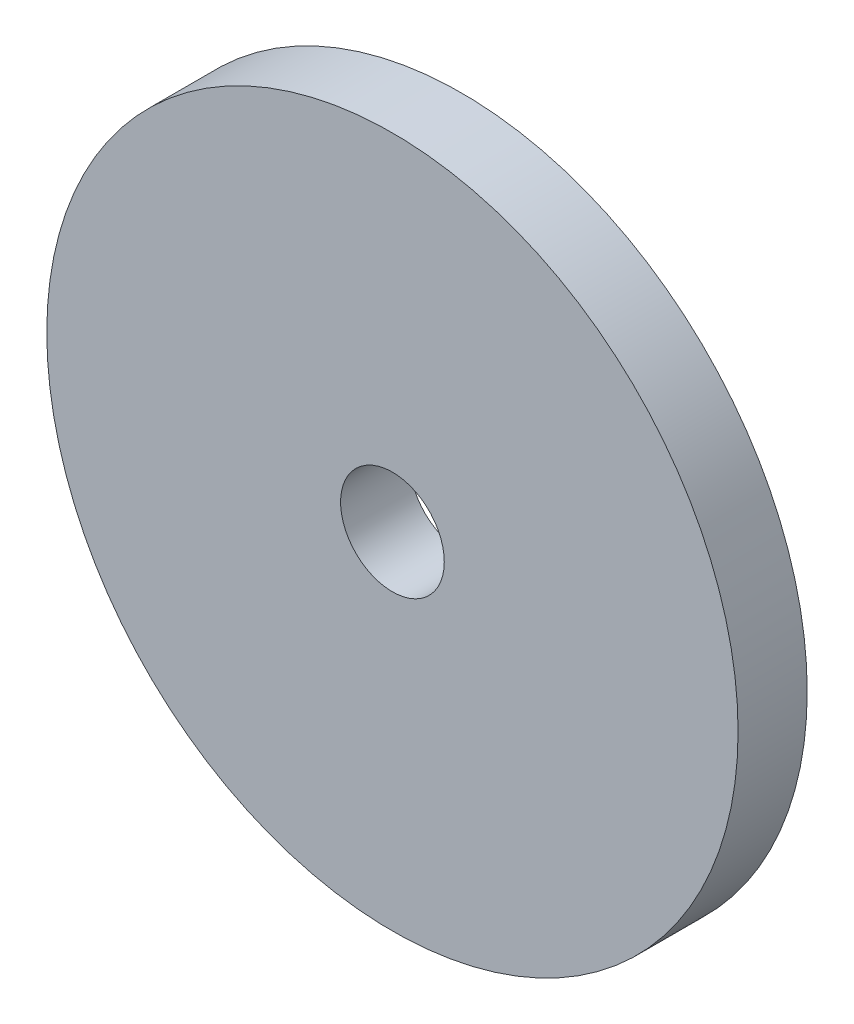
ISO-10303-21;
HEADER;
FILE_DESCRIPTION(('STEP AP214'),'2;1');
FILE_NAME('part.step','',(''),(''),'','','');
FILE_SCHEMA(('AUTOMOTIVE_DESIGN { 1 0 10303 214 1 1 1 1 }'));
ENDSEC;
DATA;
#1=APPLICATION_CONTEXT('core data for automotive mechanical design processes');
#2=APPLICATION_PROTOCOL_DEFINITION('international standard','automotive_design',2000,#1);
#3=PRODUCT_CONTEXT('',#1,'mechanical');
#4=PRODUCT('Part','Part','',(#3));
#5=PRODUCT_RELATED_PRODUCT_CATEGORY('part','',(#4));
#6=PRODUCT_DEFINITION_FORMATION('','',#4);
#7=PRODUCT_DEFINITION_CONTEXT('part definition',#1,'design');
#8=PRODUCT_DEFINITION('design','',#6,#7);
#9=PRODUCT_DEFINITION_SHAPE('','',#8);
#10=(LENGTH_UNIT() NAMED_UNIT(*) SI_UNIT(.MILLI.,.METRE.));
#11=(NAMED_UNIT(*) PLANE_ANGLE_UNIT() SI_UNIT($,.RADIAN.));
#12=(NAMED_UNIT(*) SI_UNIT($,.STERADIAN.) SOLID_ANGLE_UNIT());
#13=UNCERTAINTY_MEASURE_WITH_UNIT(LENGTH_MEASURE(1.E-05),#10,'distance_accuracy_value','');
#14=(GEOMETRIC_REPRESENTATION_CONTEXT(3) GLOBAL_UNCERTAINTY_ASSIGNED_CONTEXT((#13)) GLOBAL_UNIT_ASSIGNED_CONTEXT((#10,
#11,#12)) REPRESENTATION_CONTEXT('',''));
#15=CARTESIAN_POINT('',(0.,0.,0.));
#16=DIRECTION('',(0.,0.,1.));
#17=DIRECTION('',(1.,0.,0.));
#18=AXIS2_PLACEMENT_3D('',#15,#16,#17);
#19=CARTESIAN_POINT('',(0.,0.,2.));
#20=DIRECTION('',(0.,0.,1.));
#21=DIRECTION('',(1.,0.,0.));
#22=AXIS2_PLACEMENT_3D('',#19,#20,#21);
#23=PLANE('',#22);
#24=CARTESIAN_POINT('',(0.,0.,2.));
#25=DIRECTION('',(0.,0.,1.));
#26=DIRECTION('',(1.,0.,0.));
#27=AXIS2_PLACEMENT_3D('',#24,#25,#26);
#28=CIRCLE('',#27,10.);
#29=CARTESIAN_POINT('',(10.,0.,2.));
#30=VERTEX_POINT('',#29);
#31=EDGE_CURVE('E10',#30,#30,#28,.T.);
#32=ORIENTED_EDGE('',*,*,#31,.T.);
#33=EDGE_LOOP('',(#32));
#34=FACE_BOUND('',#33,.T.);
#35=CARTESIAN_POINT('',(0.,0.,2.));
#36=DIRECTION('',(0.,0.,1.));
#37=DIRECTION('',(1.,0.,0.));
#38=AXIS2_PLACEMENT_3D('',#35,#36,#37);
#39=CIRCLE('',#38,1.5);
#40=CARTESIAN_POINT('',(1.5,0.,2.));
#41=VERTEX_POINT('',#40);
#42=EDGE_CURVE('E54',#41,#41,#39,.T.);
#43=ORIENTED_EDGE('',*,*,#42,.F.);
#44=EDGE_LOOP('',(#43));
#45=FACE_BOUND('',#44,.T.);
#46=ADVANCED_FACE('F41',(#34,#45),#23,.T.);
#47=CARTESIAN_POINT('',(0.,0.,0.));
#48=DIRECTION('',(0.,0.,1.));
#49=DIRECTION('',(1.,0.,0.));
#50=AXIS2_PLACEMENT_3D('',#47,#48,#49);
#51=PLANE('',#50);
#52=CARTESIAN_POINT('',(0.,0.,0.));
#53=DIRECTION('',(0.,0.,1.));
#54=DIRECTION('',(1.,0.,0.));
#55=AXIS2_PLACEMENT_3D('',#52,#53,#54);
#56=CIRCLE('',#55,10.);
#57=CARTESIAN_POINT('',(10.,0.,0.));
#58=VERTEX_POINT('',#57);
#59=EDGE_CURVE('E45',#58,#58,#56,.T.);
#60=ORIENTED_EDGE('',*,*,#59,.F.);
#61=EDGE_LOOP('',(#60));
#62=FACE_BOUND('',#61,.T.);
#63=CARTESIAN_POINT('',(0.,0.,0.));
#64=DIRECTION('',(0.,0.,1.));
#65=DIRECTION('',(1.,0.,0.));
#66=AXIS2_PLACEMENT_3D('',#63,#64,#65);
#67=CIRCLE('',#66,1.5);
#68=CARTESIAN_POINT('',(1.5,0.,0.));
#69=VERTEX_POINT('',#68);
#70=EDGE_CURVE('E56',#69,#69,#67,.T.);
#71=ORIENTED_EDGE('',*,*,#70,.T.);
#72=EDGE_LOOP('',(#71));
#73=FACE_BOUND('',#72,.T.);
#74=ADVANCED_FACE('F68',(#62,#73),#51,.F.);
#75=CARTESIAN_POINT('',(0.,0.,2.));
#76=DIRECTION('',(0.,0.,-1.));
#77=DIRECTION('',(-1.,0.,0.));
#78=AXIS2_PLACEMENT_3D('',#75,#76,#77);
#79=CYLINDRICAL_SURFACE('',#78,10.);
#80=ORIENTED_EDGE('',*,*,#31,.F.);
#81=EDGE_LOOP('',(#80));
#82=FACE_BOUND('',#81,.T.);
#83=ORIENTED_EDGE('',*,*,#59,.T.);
#84=EDGE_LOOP('',(#83));
#85=FACE_BOUND('',#84,.T.);
#86=ADVANCED_FACE('F43',(#82,#85),#79,.T.);
#87=CARTESIAN_POINT('',(0.,0.,2.));
#88=DIRECTION('',(0.,0.,-1.));
#89=DIRECTION('',(-1.,0.,0.));
#90=AXIS2_PLACEMENT_3D('',#87,#88,#89);
#91=CYLINDRICAL_SURFACE('',#90,1.5);
#92=ORIENTED_EDGE('',*,*,#42,.T.);
#93=EDGE_LOOP('',(#92));
#94=FACE_BOUND('',#93,.T.);
#95=ORIENTED_EDGE('',*,*,#70,.F.);
#96=EDGE_LOOP('',(#95));
#97=FACE_BOUND('',#96,.T.);
#98=ADVANCED_FACE('F64',(#94,#97),#91,.F.);
#99=CLOSED_SHELL('',(#46,#74,#86,#98));
#100=MANIFOLD_SOLID_BREP('B2',#99);
#101=ADVANCED_BREP_SHAPE_REPRESENTATION('',(#18,#100),#14);
#102=SHAPE_DEFINITION_REPRESENTATION(#9,#101);
ENDSEC;
END-ISO-10303-21;
